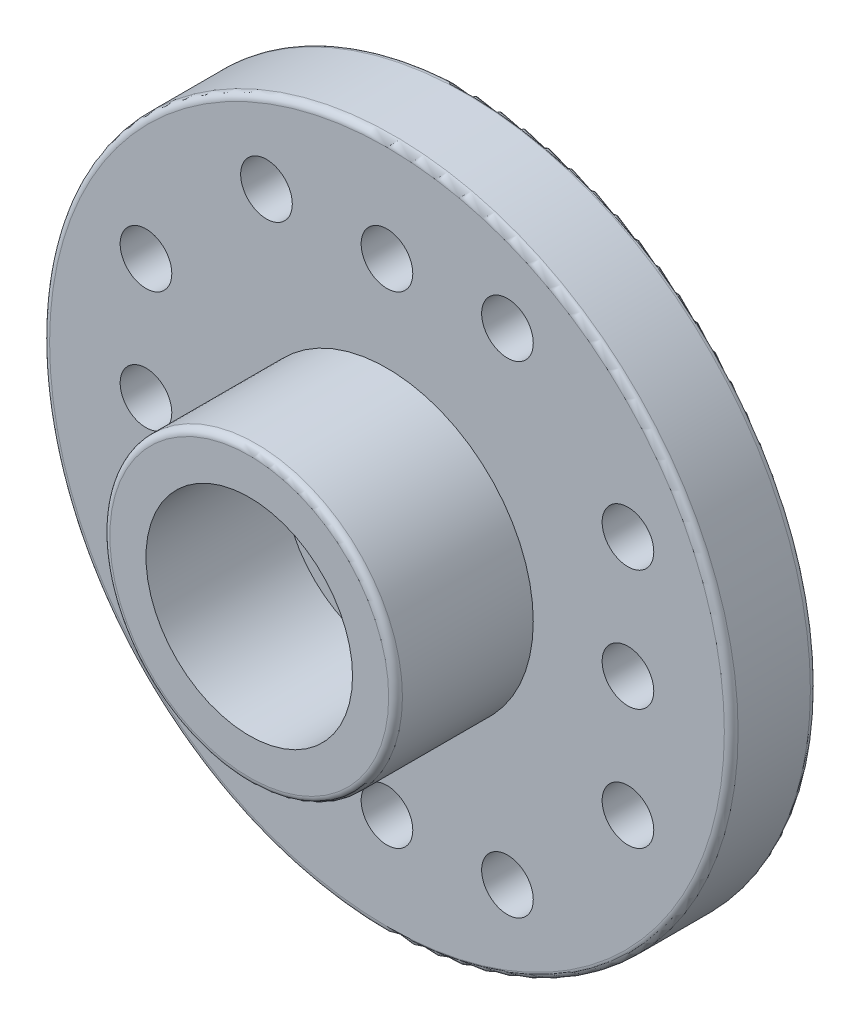
ISO-10303-21;
HEADER;
FILE_DESCRIPTION(('STEP AP214'),'2;1');
FILE_NAME('part.step','',(''),(''),'','','');
FILE_SCHEMA(('AUTOMOTIVE_DESIGN { 1 0 10303 214 1 1 1 1 }'));
ENDSEC;
DATA;
#1=APPLICATION_CONTEXT('core data for automotive mechanical design processes');
#2=APPLICATION_PROTOCOL_DEFINITION('international standard','automotive_design',2000,#1);
#3=PRODUCT_CONTEXT('',#1,'mechanical');
#4=PRODUCT('Part','Part','',(#3));
#5=PRODUCT_RELATED_PRODUCT_CATEGORY('part','',(#4));
#6=PRODUCT_DEFINITION_FORMATION('','',#4);
#7=PRODUCT_DEFINITION_CONTEXT('part definition',#1,'design');
#8=PRODUCT_DEFINITION('design','',#6,#7);
#9=PRODUCT_DEFINITION_SHAPE('','',#8);
#10=(LENGTH_UNIT() NAMED_UNIT(*) SI_UNIT(.MILLI.,.METRE.));
#11=(NAMED_UNIT(*) PLANE_ANGLE_UNIT() SI_UNIT($,.RADIAN.));
#12=(NAMED_UNIT(*) SI_UNIT($,.STERADIAN.) SOLID_ANGLE_UNIT());
#13=UNCERTAINTY_MEASURE_WITH_UNIT(LENGTH_MEASURE(1.E-05),#10,'distance_accuracy_value','');
#14=(GEOMETRIC_REPRESENTATION_CONTEXT(3) GLOBAL_UNCERTAINTY_ASSIGNED_CONTEXT((#13)) GLOBAL_UNIT_ASSIGNED_CONTEXT((#10,
#11,#12)) REPRESENTATION_CONTEXT('',''));
#15=CARTESIAN_POINT('',(0.,0.,0.));
#16=DIRECTION('',(0.,0.,1.));
#17=DIRECTION('',(1.,0.,0.));
#18=AXIS2_PLACEMENT_3D('',#15,#16,#17);
#19=CARTESIAN_POINT('',(0.,0.,0.8));
#20=DIRECTION('',(0.,0.,-1.));
#21=DIRECTION('',(-1.,0.,0.));
#22=AXIS2_PLACEMENT_3D('',#19,#20,#21);
#23=PLANE('',#22);
#24=CARTESIAN_POINT('',(0.,0.,0.8));
#25=DIRECTION('',(0.,0.,-1.));
#26=DIRECTION('',(-1.,0.,0.));
#27=AXIS2_PLACEMENT_3D('',#24,#25,#26);
#28=CIRCLE('',#27,4.5);
#29=CARTESIAN_POINT('',(-4.5,0.,0.8));
#30=VERTEX_POINT('',#29);
#31=EDGE_CURVE('E72',#30,#30,#28,.T.);
#32=ORIENTED_EDGE('',*,*,#31,.T.);
#33=EDGE_LOOP('',(#32));
#34=FACE_BOUND('',#33,.T.);
#35=CARTESIAN_POINT('',(0.,0.,0.8));
#36=DIRECTION('',(0.,0.,-1.));
#37=DIRECTION('',(-1.,0.,0.));
#38=AXIS2_PLACEMENT_3D('',#35,#36,#37);
#39=CIRCLE('',#38,3.7);
#40=CARTESIAN_POINT('',(-3.7,0.,0.8));
#41=VERTEX_POINT('',#40);
#42=EDGE_CURVE('E158',#41,#41,#39,.T.);
#43=ORIENTED_EDGE('',*,*,#42,.F.);
#44=EDGE_LOOP('',(#43));
#45=FACE_BOUND('',#44,.T.);
#46=ADVANCED_FACE('F32',(#34,#45),#23,.T.);
#47=CARTESIAN_POINT('',(0.,0.,2.5));
#48=DIRECTION('',(0.,0.,-1.));
#49=DIRECTION('',(-1.,0.,0.));
#50=AXIS2_PLACEMENT_3D('',#47,#48,#49);
#51=CYLINDRICAL_SURFACE('',#50,1.5);
#52=CARTESIAN_POINT('',(0.,0.,2.5));
#53=DIRECTION('',(0.,0.,1.));
#54=DIRECTION('',(1.,0.,0.));
#55=AXIS2_PLACEMENT_3D('',#52,#53,#54);
#56=CIRCLE('',#55,1.5);
#57=CARTESIAN_POINT('',(1.5,0.,2.5));
#58=VERTEX_POINT('',#57);
#59=EDGE_CURVE('E145',#58,#58,#56,.T.);
#60=ORIENTED_EDGE('',*,*,#59,.T.);
#61=EDGE_LOOP('',(#60));
#62=FACE_BOUND('',#61,.T.);
#63=CARTESIAN_POINT('',(0.,0.,0.8));
#64=DIRECTION('',(0.,0.,-1.));
#65=DIRECTION('',(-1.,0.,0.));
#66=AXIS2_PLACEMENT_3D('',#63,#64,#65);
#67=CIRCLE('',#66,1.5);
#68=CARTESIAN_POINT('',(-1.5,0.,0.8));
#69=VERTEX_POINT('',#68);
#70=EDGE_CURVE('E68',#69,#69,#67,.T.);
#71=ORIENTED_EDGE('',*,*,#70,.T.);
#72=EDGE_LOOP('',(#71));
#73=FACE_BOUND('',#72,.T.);
#74=ADVANCED_FACE('F187',(#62,#73),#51,.F.);
#75=CARTESIAN_POINT('',(0.,0.,2.5));
#76=DIRECTION('',(0.,0.,1.));
#77=DIRECTION('',(1.,0.,0.));
#78=AXIS2_PLACEMENT_3D('',#75,#76,#77);
#79=PLANE('',#78);
#80=CARTESIAN_POINT('',(0.,0.,2.5));
#81=DIRECTION('',(0.,0.,1.));
#82=DIRECTION('',(1.,0.,0.));
#83=AXIS2_PLACEMENT_3D('',#80,#81,#82);
#84=CIRCLE('',#83,9.79999999999866);
#85=CARTESIAN_POINT('',(9.79999999999866,0.,2.5));
#86=VERTEX_POINT('',#85);
#87=EDGE_CURVE('E10',#86,#86,#84,.T.);
#88=ORIENTED_EDGE('',*,*,#87,.T.);
#89=EDGE_LOOP('',(#88));
#90=FACE_BOUND('',#89,.T.);
#91=CARTESIAN_POINT('',(-7.,3.5,2.5));
#92=DIRECTION('',(0.,0.,1.));
#93=DIRECTION('',(1.,0.,0.));
#94=AXIS2_PLACEMENT_3D('',#91,#92,#93);
#95=CIRCLE('',#94,0.749999999999998);
#96=CARTESIAN_POINT('',(-6.25,3.5,2.5));
#97=VERTEX_POINT('',#96);
#98=EDGE_CURVE('E139',#97,#97,#95,.T.);
#99=ORIENTED_EDGE('',*,*,#98,.F.);
#100=EDGE_LOOP('',(#99));
#101=FACE_BOUND('',#100,.T.);
#102=CARTESIAN_POINT('',(-3.49999999999973,-6.99999999999993,2.5));
#103=DIRECTION('',(0.,0.,1.));
#104=DIRECTION('',(1.,0.,0.));
#105=AXIS2_PLACEMENT_3D('',#102,#103,#104);
#106=CIRCLE('',#105,0.749999999999999);
#107=CARTESIAN_POINT('',(-2.74999999999974,-6.99999999999993,2.5));
#108=VERTEX_POINT('',#107);
#109=EDGE_CURVE('E127',#108,#108,#106,.T.);
#110=ORIENTED_EDGE('',*,*,#109,.F.);
#111=EDGE_LOOP('',(#110));
#112=FACE_BOUND('',#111,.T.);
#113=CARTESIAN_POINT('',(2.65831209225568E-13,-6.99999999999993,2.5));
#114=DIRECTION('',(0.,0.,1.));
#115=DIRECTION('',(1.,0.,0.));
#116=AXIS2_PLACEMENT_3D('',#113,#114,#115);
#117=CIRCLE('',#116,0.749999999999999);
#118=CARTESIAN_POINT('',(0.750000000000265,-6.99999999999993,2.5));
#119=VERTEX_POINT('',#118);
#120=EDGE_CURVE('E115',#119,#119,#117,.T.);
#121=ORIENTED_EDGE('',*,*,#120,.F.);
#122=EDGE_LOOP('',(#121));
#123=FACE_BOUND('',#122,.T.);
#124=CARTESIAN_POINT('',(7.0000000000002,3.50000000000033,2.5));
#125=DIRECTION('',(0.,0.,1.));
#126=DIRECTION('',(1.,0.,0.));
#127=AXIS2_PLACEMENT_3D('',#124,#125,#126);
#128=CIRCLE('',#127,0.749999999999998);
#129=CARTESIAN_POINT('',(7.7500000000002,3.50000000000033,2.5));
#130=VERTEX_POINT('',#129);
#131=EDGE_CURVE('E103',#130,#130,#128,.T.);
#132=ORIENTED_EDGE('',*,*,#131,.F.);
#133=EDGE_LOOP('',(#132));
#134=FACE_BOUND('',#133,.T.);
#135=CARTESIAN_POINT('',(3.49999999999993,7.00000000000027,2.5));
#136=DIRECTION('',(0.,0.,1.));
#137=DIRECTION('',(1.,0.,0.));
#138=AXIS2_PLACEMENT_3D('',#135,#136,#137);
#139=CIRCLE('',#138,0.749999999999999);
#140=CARTESIAN_POINT('',(4.24999999999993,7.00000000000027,2.5));
#141=VERTEX_POINT('',#140);
#142=EDGE_CURVE('E91',#141,#141,#139,.T.);
#143=ORIENTED_EDGE('',*,*,#142,.F.);
#144=EDGE_LOOP('',(#143));
#145=FACE_BOUND('',#144,.T.);
#146=CARTESIAN_POINT('',(0.,7.00000000000026,2.5));
#147=DIRECTION('',(0.,0.,1.));
#148=DIRECTION('',(1.,0.,0.));
#149=AXIS2_PLACEMENT_3D('',#146,#147,#148);
#150=CIRCLE('',#149,0.749999999999999);
#151=CARTESIAN_POINT('',(0.74999999999993,7.00000000000026,2.5));
#152=VERTEX_POINT('',#151);
#153=EDGE_CURVE('E79',#152,#152,#150,.T.);
#154=ORIENTED_EDGE('',*,*,#153,.F.);
#155=EDGE_LOOP('',(#154));
#156=FACE_BOUND('',#155,.T.);
#157=CARTESIAN_POINT('',(-7.,0.,2.5));
#158=DIRECTION('',(0.,0.,1.));
#159=DIRECTION('',(1.,0.,0.));
#160=AXIS2_PLACEMENT_3D('',#157,#158,#159);
#161=CIRCLE('',#160,0.749999999999998);
#162=CARTESIAN_POINT('',(-6.25,0.,2.5));
#163=VERTEX_POINT('',#162);
#164=EDGE_CURVE('E75',#163,#163,#161,.T.);
#165=ORIENTED_EDGE('',*,*,#164,.F.);
#166=EDGE_LOOP('',(#165));
#167=FACE_BOUND('',#166,.T.);
#168=CARTESIAN_POINT('',(-3.50000000000007,7.00000000000027,2.5));
#169=DIRECTION('',(0.,0.,1.));
#170=DIRECTION('',(1.,0.,0.));
#171=AXIS2_PLACEMENT_3D('',#168,#169,#170);
#172=CIRCLE('',#171,0.749999999999998);
#173=CARTESIAN_POINT('',(-2.75000000000007,7.00000000000027,2.5));
#174=VERTEX_POINT('',#173);
#175=EDGE_CURVE('E85',#174,#174,#172,.T.);
#176=ORIENTED_EDGE('',*,*,#175,.F.);
#177=EDGE_LOOP('',(#176));
#178=FACE_BOUND('',#177,.T.);
#179=CARTESIAN_POINT('',(7.0000000000002,3.3392416014695E-13,2.5));
#180=DIRECTION('',(0.,0.,1.));
#181=DIRECTION('',(1.,0.,0.));
#182=AXIS2_PLACEMENT_3D('',#179,#180,#181);
#183=CIRCLE('',#182,0.749999999999999);
#184=CARTESIAN_POINT('',(7.7500000000002,3.3392416014695E-13,2.5));
#185=VERTEX_POINT('',#184);
#186=EDGE_CURVE('E97',#185,#185,#183,.T.);
#187=ORIENTED_EDGE('',*,*,#186,.F.);
#188=EDGE_LOOP('',(#187));
#189=FACE_BOUND('',#188,.T.);
#190=CARTESIAN_POINT('',(7.0000000000002,-3.49999999999967,2.5));
#191=DIRECTION('',(0.,0.,1.));
#192=DIRECTION('',(1.,0.,0.));
#193=AXIS2_PLACEMENT_3D('',#190,#191,#192);
#194=CIRCLE('',#193,0.749999999999998);
#195=CARTESIAN_POINT('',(7.7500000000002,-3.49999999999967,2.5));
#196=VERTEX_POINT('',#195);
#197=EDGE_CURVE('E109',#196,#196,#194,.T.);
#198=ORIENTED_EDGE('',*,*,#197,.F.);
#199=EDGE_LOOP('',(#198));
#200=FACE_BOUND('',#199,.T.);
#201=CARTESIAN_POINT('',(3.50000000000027,-6.99999999999993,2.5));
#202=DIRECTION('',(0.,0.,1.));
#203=DIRECTION('',(1.,0.,0.));
#204=AXIS2_PLACEMENT_3D('',#201,#202,#203);
#205=CIRCLE('',#204,0.749999999999998);
#206=CARTESIAN_POINT('',(4.25000000000026,-6.99999999999993,2.5));
#207=VERTEX_POINT('',#206);
#208=EDGE_CURVE('E121',#207,#207,#205,.T.);
#209=ORIENTED_EDGE('',*,*,#208,.F.);
#210=EDGE_LOOP('',(#209));
#211=FACE_BOUND('',#210,.T.);
#212=CARTESIAN_POINT('',(-7.,-3.5,2.5));
#213=DIRECTION('',(0.,0.,1.));
#214=DIRECTION('',(1.,0.,0.));
#215=AXIS2_PLACEMENT_3D('',#212,#213,#214);
#216=CIRCLE('',#215,0.749999999999998);
#217=CARTESIAN_POINT('',(-6.25,-3.5,2.5));
#218=VERTEX_POINT('',#217);
#219=EDGE_CURVE('E133',#218,#218,#216,.T.);
#220=ORIENTED_EDGE('',*,*,#219,.F.);
#221=EDGE_LOOP('',(#220));
#222=FACE_BOUND('',#221,.T.);
#223=CARTESIAN_POINT('',(0.,0.,2.5));
#224=DIRECTION('',(0.,0.,1.));
#225=DIRECTION('',(1.,0.,0.));
#226=AXIS2_PLACEMENT_3D('',#223,#224,#225);
#227=CIRCLE('',#226,4.25);
#228=CARTESIAN_POINT('',(4.25,0.,2.5));
#229=VERTEX_POINT('',#228);
#230=EDGE_CURVE('E150',#229,#229,#227,.T.);
#231=ORIENTED_EDGE('',*,*,#230,.F.);
#232=EDGE_LOOP('',(#231));
#233=FACE_BOUND('',#232,.T.);
#234=ADVANCED_FACE('F192',(#90,#101,#112,#123,#134,#145,#156,#167,#178,#189,#200,#211,#222,
#233),#79,.T.);
#235=CARTESIAN_POINT('',(0.,0.,2.5));
#236=DIRECTION('',(0.,0.,1.));
#237=DIRECTION('',(1.,0.,0.));
#238=AXIS2_PLACEMENT_3D('',#235,#236,#237);
#239=CIRCLE('',#238,3.);
#240=CARTESIAN_POINT('',(3.,0.,2.5));
#241=VERTEX_POINT('',#240);
#242=EDGE_CURVE('E67',#241,#241,#239,.F.);
#243=ORIENTED_EDGE('',*,*,#242,.F.);
#244=EDGE_LOOP('',(#243));
#245=FACE_BOUND('',#244,.T.);
#246=ORIENTED_EDGE('',*,*,#59,.F.);
#247=EDGE_LOOP('',(#246));
#248=FACE_BOUND('',#247,.T.);
#249=ADVANCED_FACE('F261',(#245,#248),#79,.T.);
#250=CARTESIAN_POINT('',(0.,0.,0.));
#251=DIRECTION('',(0.,0.,1.));
#252=DIRECTION('',(1.,0.,0.));
#253=AXIS2_PLACEMENT_3D('',#250,#251,#252);
#254=PLANE('',#253);
#255=CARTESIAN_POINT('',(0.,0.,0.));
#256=DIRECTION('',(0.,0.,1.));
#257=DIRECTION('',(1.,0.,0.));
#258=AXIS2_PLACEMENT_3D('',#255,#256,#257);
#259=CIRCLE('',#258,4.7);
#260=CARTESIAN_POINT('',(4.7,0.,0.));
#261=VERTEX_POINT('',#260);
#262=EDGE_CURVE('E55',#261,#261,#259,.T.);
#263=ORIENTED_EDGE('',*,*,#262,.T.);
#264=EDGE_LOOP('',(#263));
#265=FACE_BOUND('',#264,.T.);
#266=CARTESIAN_POINT('',(0.,0.,0.));
#267=DIRECTION('',(0.,0.,1.));
#268=DIRECTION('',(1.,0.,0.));
#269=AXIS2_PLACEMENT_3D('',#266,#267,#268);
#270=CIRCLE('',#269,9.79999999999866);
#271=CARTESIAN_POINT('',(9.79999999999866,0.,0.));
#272=VERTEX_POINT('',#271);
#273=EDGE_CURVE('E58',#272,#272,#270,.F.);
#274=ORIENTED_EDGE('',*,*,#273,.T.);
#275=EDGE_LOOP('',(#274));
#276=FACE_BOUND('',#275,.T.);
#277=CARTESIAN_POINT('',(-7.,3.5,0.));
#278=DIRECTION('',(0.,0.,1.));
#279=DIRECTION('',(1.,0.,0.));
#280=AXIS2_PLACEMENT_3D('',#277,#278,#279);
#281=CIRCLE('',#280,0.749999999999998);
#282=CARTESIAN_POINT('',(-6.25,3.5,0.));
#283=VERTEX_POINT('',#282);
#284=EDGE_CURVE('E142',#283,#283,#281,.T.);
#285=ORIENTED_EDGE('',*,*,#284,.T.);
#286=EDGE_LOOP('',(#285));
#287=FACE_BOUND('',#286,.T.);
#288=CARTESIAN_POINT('',(-3.49999999999973,-6.99999999999993,0.));
#289=DIRECTION('',(0.,0.,1.));
#290=DIRECTION('',(1.,0.,0.));
#291=AXIS2_PLACEMENT_3D('',#288,#289,#290);
#292=CIRCLE('',#291,0.749999999999999);
#293=CARTESIAN_POINT('',(-2.74999999999974,-6.99999999999993,0.));
#294=VERTEX_POINT('',#293);
#295=EDGE_CURVE('E130',#294,#294,#292,.T.);
#296=ORIENTED_EDGE('',*,*,#295,.T.);
#297=EDGE_LOOP('',(#296));
#298=FACE_BOUND('',#297,.T.);
#299=CARTESIAN_POINT('',(2.65831209225568E-13,-6.99999999999993,0.));
#300=DIRECTION('',(0.,0.,1.));
#301=DIRECTION('',(1.,0.,0.));
#302=AXIS2_PLACEMENT_3D('',#299,#300,#301);
#303=CIRCLE('',#302,0.749999999999999);
#304=CARTESIAN_POINT('',(0.750000000000265,-6.99999999999993,0.));
#305=VERTEX_POINT('',#304);
#306=EDGE_CURVE('E118',#305,#305,#303,.T.);
#307=ORIENTED_EDGE('',*,*,#306,.T.);
#308=EDGE_LOOP('',(#307));
#309=FACE_BOUND('',#308,.T.);
#310=CARTESIAN_POINT('',(7.0000000000002,3.50000000000033,0.));
#311=DIRECTION('',(0.,0.,1.));
#312=DIRECTION('',(1.,0.,0.));
#313=AXIS2_PLACEMENT_3D('',#310,#311,#312);
#314=CIRCLE('',#313,0.749999999999998);
#315=CARTESIAN_POINT('',(7.7500000000002,3.50000000000033,0.));
#316=VERTEX_POINT('',#315);
#317=EDGE_CURVE('E106',#316,#316,#314,.T.);
#318=ORIENTED_EDGE('',*,*,#317,.T.);
#319=EDGE_LOOP('',(#318));
#320=FACE_BOUND('',#319,.T.);
#321=CARTESIAN_POINT('',(3.49999999999993,7.00000000000027,0.));
#322=DIRECTION('',(0.,0.,1.));
#323=DIRECTION('',(1.,0.,0.));
#324=AXIS2_PLACEMENT_3D('',#321,#322,#323);
#325=CIRCLE('',#324,0.749999999999999);
#326=CARTESIAN_POINT('',(4.24999999999993,7.00000000000027,0.));
#327=VERTEX_POINT('',#326);
#328=EDGE_CURVE('E94',#327,#327,#325,.T.);
#329=ORIENTED_EDGE('',*,*,#328,.T.);
#330=EDGE_LOOP('',(#329));
#331=FACE_BOUND('',#330,.T.);
#332=CARTESIAN_POINT('',(0.,7.00000000000026,0.));
#333=DIRECTION('',(0.,0.,1.));
#334=DIRECTION('',(1.,0.,0.));
#335=AXIS2_PLACEMENT_3D('',#332,#333,#334);
#336=CIRCLE('',#335,0.749999999999999);
#337=CARTESIAN_POINT('',(0.74999999999993,7.00000000000026,0.));
#338=VERTEX_POINT('',#337);
#339=EDGE_CURVE('E82',#338,#338,#336,.T.);
#340=ORIENTED_EDGE('',*,*,#339,.T.);
#341=EDGE_LOOP('',(#340));
#342=FACE_BOUND('',#341,.T.);
#343=CARTESIAN_POINT('',(-7.,0.,0.));
#344=DIRECTION('',(0.,0.,1.));
#345=DIRECTION('',(1.,0.,0.));
#346=AXIS2_PLACEMENT_3D('',#343,#344,#345);
#347=CIRCLE('',#346,0.749999999999998);
#348=CARTESIAN_POINT('',(-6.25,0.,0.));
#349=VERTEX_POINT('',#348);
#350=EDGE_CURVE('E76',#349,#349,#347,.T.);
#351=ORIENTED_EDGE('',*,*,#350,.T.);
#352=EDGE_LOOP('',(#351));
#353=FACE_BOUND('',#352,.T.);
#354=CARTESIAN_POINT('',(-3.50000000000007,7.00000000000027,0.));
#355=DIRECTION('',(0.,0.,1.));
#356=DIRECTION('',(1.,0.,0.));
#357=AXIS2_PLACEMENT_3D('',#354,#355,#356);
#358=CIRCLE('',#357,0.749999999999998);
#359=CARTESIAN_POINT('',(-2.75000000000007,7.00000000000027,0.));
#360=VERTEX_POINT('',#359);
#361=EDGE_CURVE('E88',#360,#360,#358,.T.);
#362=ORIENTED_EDGE('',*,*,#361,.T.);
#363=EDGE_LOOP('',(#362));
#364=FACE_BOUND('',#363,.T.);
#365=CARTESIAN_POINT('',(7.0000000000002,3.3392416014695E-13,0.));
#366=DIRECTION('',(0.,0.,1.));
#367=DIRECTION('',(1.,0.,0.));
#368=AXIS2_PLACEMENT_3D('',#365,#366,#367);
#369=CIRCLE('',#368,0.749999999999999);
#370=CARTESIAN_POINT('',(7.7500000000002,3.3392416014695E-13,0.));
#371=VERTEX_POINT('',#370);
#372=EDGE_CURVE('E100',#371,#371,#369,.T.);
#373=ORIENTED_EDGE('',*,*,#372,.T.);
#374=EDGE_LOOP('',(#373));
#375=FACE_BOUND('',#374,.T.);
#376=CARTESIAN_POINT('',(7.0000000000002,-3.49999999999967,0.));
#377=DIRECTION('',(0.,0.,1.));
#378=DIRECTION('',(1.,0.,0.));
#379=AXIS2_PLACEMENT_3D('',#376,#377,#378);
#380=CIRCLE('',#379,0.749999999999998);
#381=CARTESIAN_POINT('',(7.7500000000002,-3.49999999999967,0.));
#382=VERTEX_POINT('',#381);
#383=EDGE_CURVE('E112',#382,#382,#380,.T.);
#384=ORIENTED_EDGE('',*,*,#383,.T.);
#385=EDGE_LOOP('',(#384));
#386=FACE_BOUND('',#385,.T.);
#387=CARTESIAN_POINT('',(3.50000000000027,-6.99999999999993,0.));
#388=DIRECTION('',(0.,0.,1.));
#389=DIRECTION('',(1.,0.,0.));
#390=AXIS2_PLACEMENT_3D('',#387,#388,#389);
#391=CIRCLE('',#390,0.749999999999998);
#392=CARTESIAN_POINT('',(4.25000000000026,-6.99999999999993,0.));
#393=VERTEX_POINT('',#392);
#394=EDGE_CURVE('E124',#393,#393,#391,.T.);
#395=ORIENTED_EDGE('',*,*,#394,.T.);
#396=EDGE_LOOP('',(#395));
#397=FACE_BOUND('',#396,.T.);
#398=CARTESIAN_POINT('',(-7.,-3.5,0.));
#399=DIRECTION('',(0.,0.,1.));
#400=DIRECTION('',(1.,0.,0.));
#401=AXIS2_PLACEMENT_3D('',#398,#399,#400);
#402=CIRCLE('',#401,0.749999999999998);
#403=CARTESIAN_POINT('',(-6.25,-3.5,0.));
#404=VERTEX_POINT('',#403);
#405=EDGE_CURVE('E136',#404,#404,#402,.T.);
#406=ORIENTED_EDGE('',*,*,#405,.T.);
#407=EDGE_LOOP('',(#406));
#408=FACE_BOUND('',#407,.T.);
#409=ADVANCED_FACE('F264',(#265,#276,#287,#298,#309,#320,#331,#342,#353,#364,#375,#386,#397,
#408),#254,.F.);
#410=CARTESIAN_POINT('',(0.,0.,2.5));
#411=DIRECTION('',(0.,0.,-1.));
#412=DIRECTION('',(-1.,0.,0.));
#413=AXIS2_PLACEMENT_3D('',#410,#411,#412);
#414=CYLINDRICAL_SURFACE('',#413,9.99999999999866);
#415=CARTESIAN_POINT('',(0.,0.,0.2));
#416=DIRECTION('',(0.,0.,1.));
#417=DIRECTION('',(1.,0.,0.));
#418=AXIS2_PLACEMENT_3D('',#415,#416,#417);
#419=CIRCLE('',#418,9.99999999999866);
#420=CARTESIAN_POINT('',(9.99999999999866,0.,0.2));
#421=VERTEX_POINT('',#420);
#422=EDGE_CURVE('E39',#421,#421,#419,.T.);
#423=ORIENTED_EDGE('',*,*,#422,.T.);
#424=EDGE_LOOP('',(#423));
#425=FACE_BOUND('',#424,.T.);
#426=CARTESIAN_POINT('',(0.,0.,2.3));
#427=DIRECTION('',(0.,0.,1.));
#428=DIRECTION('',(1.,0.,0.));
#429=AXIS2_PLACEMENT_3D('',#426,#427,#428);
#430=CIRCLE('',#429,9.99999999999866);
#431=CARTESIAN_POINT('',(9.99999999999866,0.,2.3));
#432=VERTEX_POINT('',#431);
#433=EDGE_CURVE('E43',#432,#432,#430,.F.);
#434=ORIENTED_EDGE('',*,*,#433,.T.);
#435=EDGE_LOOP('',(#434));
#436=FACE_BOUND('',#435,.T.);
#437=ADVANCED_FACE('F259',(#425,#436),#414,.T.);
#438=CARTESIAN_POINT('',(-7.,0.,2.5));
#439=DIRECTION('',(0.,0.,-1.));
#440=DIRECTION('',(-1.,0.,0.));
#441=AXIS2_PLACEMENT_3D('',#438,#439,#440);
#442=CYLINDRICAL_SURFACE('',#441,0.749999999999998);
#443=ORIENTED_EDGE('',*,*,#164,.T.);
#444=EDGE_LOOP('',(#443));
#445=FACE_BOUND('',#444,.T.);
#446=ORIENTED_EDGE('',*,*,#350,.F.);
#447=EDGE_LOOP('',(#446));
#448=FACE_BOUND('',#447,.T.);
#449=ADVANCED_FACE('F255',(#445,#448),#442,.F.);
#450=CARTESIAN_POINT('',(0.,7.00000000000026,2.5));
#451=DIRECTION('',(0.,0.,-1.));
#452=DIRECTION('',(-1.,0.,0.));
#453=AXIS2_PLACEMENT_3D('',#450,#451,#452);
#454=CYLINDRICAL_SURFACE('',#453,0.749999999999999);
#455=ORIENTED_EDGE('',*,*,#153,.T.);
#456=EDGE_LOOP('',(#455));
#457=FACE_BOUND('',#456,.T.);
#458=ORIENTED_EDGE('',*,*,#339,.F.);
#459=EDGE_LOOP('',(#458));
#460=FACE_BOUND('',#459,.T.);
#461=ADVANCED_FACE('F251',(#457,#460),#454,.F.);
#462=CARTESIAN_POINT('',(-3.50000000000007,7.00000000000027,2.5));
#463=DIRECTION('',(0.,0.,-1.));
#464=DIRECTION('',(-1.,0.,0.));
#465=AXIS2_PLACEMENT_3D('',#462,#463,#464);
#466=CYLINDRICAL_SURFACE('',#465,0.749999999999998);
#467=ORIENTED_EDGE('',*,*,#175,.T.);
#468=EDGE_LOOP('',(#467));
#469=FACE_BOUND('',#468,.T.);
#470=ORIENTED_EDGE('',*,*,#361,.F.);
#471=EDGE_LOOP('',(#470));
#472=FACE_BOUND('',#471,.T.);
#473=ADVANCED_FACE('F247',(#469,#472),#466,.F.);
#474=CARTESIAN_POINT('',(3.49999999999993,7.00000000000027,2.5));
#475=DIRECTION('',(0.,0.,-1.));
#476=DIRECTION('',(-1.,0.,0.));
#477=AXIS2_PLACEMENT_3D('',#474,#475,#476);
#478=CYLINDRICAL_SURFACE('',#477,0.749999999999999);
#479=ORIENTED_EDGE('',*,*,#142,.T.);
#480=EDGE_LOOP('',(#479));
#481=FACE_BOUND('',#480,.T.);
#482=ORIENTED_EDGE('',*,*,#328,.F.);
#483=EDGE_LOOP('',(#482));
#484=FACE_BOUND('',#483,.T.);
#485=ADVANCED_FACE('F243',(#481,#484),#478,.F.);
#486=CARTESIAN_POINT('',(7.0000000000002,3.3392416014695E-13,2.5));
#487=DIRECTION('',(0.,0.,-1.));
#488=DIRECTION('',(-1.,0.,0.));
#489=AXIS2_PLACEMENT_3D('',#486,#487,#488);
#490=CYLINDRICAL_SURFACE('',#489,0.749999999999999);
#491=ORIENTED_EDGE('',*,*,#186,.T.);
#492=EDGE_LOOP('',(#491));
#493=FACE_BOUND('',#492,.T.);
#494=ORIENTED_EDGE('',*,*,#372,.F.);
#495=EDGE_LOOP('',(#494));
#496=FACE_BOUND('',#495,.T.);
#497=ADVANCED_FACE('F239',(#493,#496),#490,.F.);
#498=CARTESIAN_POINT('',(7.0000000000002,3.50000000000033,2.5));
#499=DIRECTION('',(0.,0.,-1.));
#500=DIRECTION('',(-1.,0.,0.));
#501=AXIS2_PLACEMENT_3D('',#498,#499,#500);
#502=CYLINDRICAL_SURFACE('',#501,0.749999999999998);
#503=ORIENTED_EDGE('',*,*,#131,.T.);
#504=EDGE_LOOP('',(#503));
#505=FACE_BOUND('',#504,.T.);
#506=ORIENTED_EDGE('',*,*,#317,.F.);
#507=EDGE_LOOP('',(#506));
#508=FACE_BOUND('',#507,.T.);
#509=ADVANCED_FACE('F235',(#505,#508),#502,.F.);
#510=CARTESIAN_POINT('',(7.0000000000002,-3.49999999999967,2.5));
#511=DIRECTION('',(0.,0.,-1.));
#512=DIRECTION('',(-1.,0.,0.));
#513=AXIS2_PLACEMENT_3D('',#510,#511,#512);
#514=CYLINDRICAL_SURFACE('',#513,0.749999999999998);
#515=ORIENTED_EDGE('',*,*,#197,.T.);
#516=EDGE_LOOP('',(#515));
#517=FACE_BOUND('',#516,.T.);
#518=ORIENTED_EDGE('',*,*,#383,.F.);
#519=EDGE_LOOP('',(#518));
#520=FACE_BOUND('',#519,.T.);
#521=ADVANCED_FACE('F231',(#517,#520),#514,.F.);
#522=CARTESIAN_POINT('',(2.65831209225568E-13,-6.99999999999993,2.5));
#523=DIRECTION('',(0.,0.,-1.));
#524=DIRECTION('',(-1.,0.,0.));
#525=AXIS2_PLACEMENT_3D('',#522,#523,#524);
#526=CYLINDRICAL_SURFACE('',#525,0.749999999999999);
#527=ORIENTED_EDGE('',*,*,#120,.T.);
#528=EDGE_LOOP('',(#527));
#529=FACE_BOUND('',#528,.T.);
#530=ORIENTED_EDGE('',*,*,#306,.F.);
#531=EDGE_LOOP('',(#530));
#532=FACE_BOUND('',#531,.T.);
#533=ADVANCED_FACE('F227',(#529,#532),#526,.F.);
#534=CARTESIAN_POINT('',(3.50000000000027,-6.99999999999993,2.5));
#535=DIRECTION('',(0.,0.,-1.));
#536=DIRECTION('',(-1.,0.,0.));
#537=AXIS2_PLACEMENT_3D('',#534,#535,#536);
#538=CYLINDRICAL_SURFACE('',#537,0.749999999999998);
#539=ORIENTED_EDGE('',*,*,#208,.T.);
#540=EDGE_LOOP('',(#539));
#541=FACE_BOUND('',#540,.T.);
#542=ORIENTED_EDGE('',*,*,#394,.F.);
#543=EDGE_LOOP('',(#542));
#544=FACE_BOUND('',#543,.T.);
#545=ADVANCED_FACE('F223',(#541,#544),#538,.F.);
#546=CARTESIAN_POINT('',(-3.49999999999973,-6.99999999999993,2.5));
#547=DIRECTION('',(0.,0.,-1.));
#548=DIRECTION('',(-1.,0.,0.));
#549=AXIS2_PLACEMENT_3D('',#546,#547,#548);
#550=CYLINDRICAL_SURFACE('',#549,0.749999999999999);
#551=ORIENTED_EDGE('',*,*,#109,.T.);
#552=EDGE_LOOP('',(#551));
#553=FACE_BOUND('',#552,.T.);
#554=ORIENTED_EDGE('',*,*,#295,.F.);
#555=EDGE_LOOP('',(#554));
#556=FACE_BOUND('',#555,.T.);
#557=ADVANCED_FACE('F219',(#553,#556),#550,.F.);
#558=CARTESIAN_POINT('',(-7.,-3.5,2.5));
#559=DIRECTION('',(0.,0.,-1.));
#560=DIRECTION('',(-1.,0.,0.));
#561=AXIS2_PLACEMENT_3D('',#558,#559,#560);
#562=CYLINDRICAL_SURFACE('',#561,0.749999999999998);
#563=ORIENTED_EDGE('',*,*,#219,.T.);
#564=EDGE_LOOP('',(#563));
#565=FACE_BOUND('',#564,.T.);
#566=ORIENTED_EDGE('',*,*,#405,.F.);
#567=EDGE_LOOP('',(#566));
#568=FACE_BOUND('',#567,.T.);
#569=ADVANCED_FACE('F215',(#565,#568),#562,.F.);
#570=CARTESIAN_POINT('',(-7.,3.5,2.5));
#571=DIRECTION('',(0.,0.,-1.));
#572=DIRECTION('',(-1.,0.,0.));
#573=AXIS2_PLACEMENT_3D('',#570,#571,#572);
#574=CYLINDRICAL_SURFACE('',#573,0.749999999999998);
#575=ORIENTED_EDGE('',*,*,#98,.T.);
#576=EDGE_LOOP('',(#575));
#577=FACE_BOUND('',#576,.T.);
#578=ORIENTED_EDGE('',*,*,#284,.F.);
#579=EDGE_LOOP('',(#578));
#580=FACE_BOUND('',#579,.T.);
#581=ADVANCED_FACE('F208',(#577,#580),#574,.F.);
#582=CARTESIAN_POINT('',(0.,0.,6.5));
#583=DIRECTION('',(0.,0.,1.));
#584=DIRECTION('',(1.,0.,0.));
#585=AXIS2_PLACEMENT_3D('',#582,#583,#584);
#586=PLANE('',#585);
#587=CARTESIAN_POINT('',(0.,0.,6.5));
#588=DIRECTION('',(0.,0.,1.));
#589=DIRECTION('',(1.,0.,0.));
#590=AXIS2_PLACEMENT_3D('',#587,#588,#589);
#591=CIRCLE('',#590,4.05);
#592=CARTESIAN_POINT('',(4.05,0.,6.5));
#593=VERTEX_POINT('',#592);
#594=EDGE_CURVE('E52',#593,#593,#591,.T.);
#595=ORIENTED_EDGE('',*,*,#594,.T.);
#596=EDGE_LOOP('',(#595));
#597=FACE_BOUND('',#596,.T.);
#598=CARTESIAN_POINT('',(0.,0.,6.5));
#599=DIRECTION('',(0.,0.,1.));
#600=DIRECTION('',(1.,0.,0.));
#601=AXIS2_PLACEMENT_3D('',#598,#599,#600);
#602=CIRCLE('',#601,3.);
#603=CARTESIAN_POINT('',(3.,0.,6.5));
#604=VERTEX_POINT('',#603);
#605=EDGE_CURVE('E71',#604,#604,#602,.T.);
#606=ORIENTED_EDGE('',*,*,#605,.F.);
#607=EDGE_LOOP('',(#606));
#608=FACE_BOUND('',#607,.T.);
#609=ADVANCED_FACE('F205',(#597,#608),#586,.T.);
#610=CARTESIAN_POINT('',(0.,0.,6.5));
#611=DIRECTION('',(0.,0.,-1.));
#612=DIRECTION('',(-1.,0.,0.));
#613=AXIS2_PLACEMENT_3D('',#610,#611,#612);
#614=CYLINDRICAL_SURFACE('',#613,4.25);
#615=CARTESIAN_POINT('',(0.,0.,6.3));
#616=DIRECTION('',(0.,0.,1.));
#617=DIRECTION('',(1.,0.,0.));
#618=AXIS2_PLACEMENT_3D('',#615,#616,#617);
#619=CIRCLE('',#618,4.25);
#620=CARTESIAN_POINT('',(4.25,0.,6.3));
#621=VERTEX_POINT('',#620);
#622=EDGE_CURVE('E47',#621,#621,#619,.F.);
#623=ORIENTED_EDGE('',*,*,#622,.T.);
#624=EDGE_LOOP('',(#623));
#625=FACE_BOUND('',#624,.T.);
#626=ORIENTED_EDGE('',*,*,#230,.T.);
#627=EDGE_LOOP('',(#626));
#628=FACE_BOUND('',#627,.T.);
#629=ADVANCED_FACE('F203',(#625,#628),#614,.T.);
#630=CARTESIAN_POINT('',(0.,0.,6.5));
#631=DIRECTION('',(0.,0.,-1.));
#632=DIRECTION('',(-1.,0.,0.));
#633=AXIS2_PLACEMENT_3D('',#630,#631,#632);
#634=CYLINDRICAL_SURFACE('',#633,3.);
#635=ORIENTED_EDGE('',*,*,#605,.T.);
#636=EDGE_LOOP('',(#635));
#637=FACE_BOUND('',#636,.T.);
#638=ORIENTED_EDGE('',*,*,#242,.T.);
#639=EDGE_LOOP('',(#638));
#640=FACE_BOUND('',#639,.T.);
#641=ADVANCED_FACE('F199',(#637,#640),#634,.F.);
#642=CARTESIAN_POINT('',(0.,0.,0.8));
#643=DIRECTION('',(0.,0.,-1.));
#644=DIRECTION('',(-1.,0.,0.));
#645=AXIS2_PLACEMENT_3D('',#642,#643,#644);
#646=CYLINDRICAL_SURFACE('',#645,4.5);
#647=CARTESIAN_POINT('',(0.,0.,0.2));
#648=DIRECTION('',(0.,0.,1.));
#649=DIRECTION('',(1.,0.,0.));
#650=AXIS2_PLACEMENT_3D('',#647,#648,#649);
#651=CIRCLE('',#650,4.5);
#652=CARTESIAN_POINT('',(4.5,0.,0.2));
#653=VERTEX_POINT('',#652);
#654=EDGE_CURVE('E61',#653,#653,#651,.F.);
#655=ORIENTED_EDGE('',*,*,#654,.T.);
#656=EDGE_LOOP('',(#655));
#657=FACE_BOUND('',#656,.T.);
#658=ORIENTED_EDGE('',*,*,#31,.F.);
#659=EDGE_LOOP('',(#658));
#660=FACE_BOUND('',#659,.T.);
#661=ADVANCED_FACE('F182',(#657,#660),#646,.F.);
#662=CARTESIAN_POINT('',(0.,0.,0.8));
#663=DIRECTION('',(0.,0.,-1.));
#664=DIRECTION('',(-1.,0.,0.));
#665=AXIS2_PLACEMENT_3D('',#662,#663,#664);
#666=CIRCLE('',#665,3.5);
#667=CARTESIAN_POINT('',(-3.5,0.,0.8));
#668=VERTEX_POINT('',#667);
#669=EDGE_CURVE('E64',#668,#668,#666,.F.);
#670=ORIENTED_EDGE('',*,*,#669,.F.);
#671=EDGE_LOOP('',(#670));
#672=FACE_BOUND('',#671,.T.);
#673=ORIENTED_EDGE('',*,*,#70,.F.);
#674=EDGE_LOOP('',(#673));
#675=FACE_BOUND('',#674,.T.);
#676=ADVANCED_FACE('F173',(#672,#675),#23,.T.);
#677=CARTESIAN_POINT('',(0.,0.,0.));
#678=DIRECTION('',(0.,0.,-1.));
#679=DIRECTION('',(-1.,0.,0.));
#680=AXIS2_PLACEMENT_3D('',#677,#678,#679);
#681=PLANE('',#680);
#682=CARTESIAN_POINT('',(0.,0.,0.));
#683=DIRECTION('',(0.,0.,-1.));
#684=DIRECTION('',(-1.,0.,0.));
#685=AXIS2_PLACEMENT_3D('',#682,#683,#684);
#686=CIRCLE('',#685,3.7);
#687=CARTESIAN_POINT('',(-3.7,0.,0.));
#688=VERTEX_POINT('',#687);
#689=EDGE_CURVE('E157',#688,#688,#686,.T.);
#690=ORIENTED_EDGE('',*,*,#689,.T.);
#691=EDGE_LOOP('',(#690));
#692=FACE_BOUND('',#691,.T.);
#693=CARTESIAN_POINT('',(0.,0.,0.));
#694=DIRECTION('',(0.,0.,-1.));
#695=DIRECTION('',(-1.,0.,0.));
#696=AXIS2_PLACEMENT_3D('',#693,#694,#695);
#697=CIRCLE('',#696,3.5);
#698=CARTESIAN_POINT('',(-3.5,0.,0.));
#699=VERTEX_POINT('',#698);
#700=EDGE_CURVE('E161',#699,#699,#697,.T.);
#701=ORIENTED_EDGE('',*,*,#700,.F.);
#702=EDGE_LOOP('',(#701));
#703=FACE_BOUND('',#702,.T.);
#704=ADVANCED_FACE('F170',(#692,#703),#681,.T.);
#705=CARTESIAN_POINT('',(0.,0.,0.));
#706=DIRECTION('',(0.,0.,1.));
#707=DIRECTION('',(1.,0.,0.));
#708=AXIS2_PLACEMENT_3D('',#705,#706,#707);
#709=CYLINDRICAL_SURFACE('',#708,3.7);
#710=ORIENTED_EDGE('',*,*,#689,.F.);
#711=EDGE_LOOP('',(#710));
#712=FACE_BOUND('',#711,.T.);
#713=ORIENTED_EDGE('',*,*,#42,.T.);
#714=EDGE_LOOP('',(#713));
#715=FACE_BOUND('',#714,.T.);
#716=ADVANCED_FACE('F172',(#712,#715),#709,.T.);
#717=CARTESIAN_POINT('',(0.,0.,0.));
#718=DIRECTION('',(0.,0.,1.));
#719=DIRECTION('',(1.,0.,0.));
#720=AXIS2_PLACEMENT_3D('',#717,#718,#719);
#721=CYLINDRICAL_SURFACE('',#720,3.5);
#722=ORIENTED_EDGE('',*,*,#700,.T.);
#723=EDGE_LOOP('',(#722));
#724=FACE_BOUND('',#723,.T.);
#725=ORIENTED_EDGE('',*,*,#669,.T.);
#726=EDGE_LOOP('',(#725));
#727=FACE_BOUND('',#726,.T.);
#728=ADVANCED_FACE('F167',(#724,#727),#721,.F.);
#729=CARTESIAN_POINT('',(0.,0.,0.2));
#730=DIRECTION('',(0.,0.,1.));
#731=DIRECTION('',(1.,0.,0.));
#732=AXIS2_PLACEMENT_3D('',#729,#730,#731);
#733=TOROIDAL_SURFACE('',#732,4.7,0.2);
#734=ORIENTED_EDGE('',*,*,#262,.F.);
#735=EDGE_LOOP('',(#734));
#736=FACE_BOUND('',#735,.T.);
#737=ORIENTED_EDGE('',*,*,#654,.F.);
#738=EDGE_LOOP('',(#737));
#739=FACE_BOUND('',#738,.T.);
#740=ADVANCED_FACE('F271',(#736,#739),#733,.T.);
#741=CARTESIAN_POINT('',(0.,0.,6.3));
#742=DIRECTION('',(0.,0.,1.));
#743=DIRECTION('',(1.,0.,0.));
#744=AXIS2_PLACEMENT_3D('',#741,#742,#743);
#745=TOROIDAL_SURFACE('',#744,4.05,0.2);
#746=ORIENTED_EDGE('',*,*,#622,.F.);
#747=EDGE_LOOP('',(#746));
#748=FACE_BOUND('',#747,.T.);
#749=ORIENTED_EDGE('',*,*,#594,.F.);
#750=EDGE_LOOP('',(#749));
#751=FACE_BOUND('',#750,.T.);
#752=ADVANCED_FACE('F274',(#748,#751),#745,.T.);
#753=CARTESIAN_POINT('',(0.,0.,0.2));
#754=DIRECTION('',(0.,0.,1.));
#755=DIRECTION('',(1.,0.,0.));
#756=AXIS2_PLACEMENT_3D('',#753,#754,#755);
#757=TOROIDAL_SURFACE('',#756,9.79999999999866,0.2);
#758=ORIENTED_EDGE('',*,*,#273,.F.);
#759=EDGE_LOOP('',(#758));
#760=FACE_BOUND('',#759,.T.);
#761=ORIENTED_EDGE('',*,*,#422,.F.);
#762=EDGE_LOOP('',(#761));
#763=FACE_BOUND('',#762,.T.);
#764=ADVANCED_FACE('F277',(#760,#763),#757,.T.);
#765=CARTESIAN_POINT('',(0.,0.,2.3));
#766=DIRECTION('',(0.,0.,1.));
#767=DIRECTION('',(1.,0.,0.));
#768=AXIS2_PLACEMENT_3D('',#765,#766,#767);
#769=TOROIDAL_SURFACE('',#768,9.79999999999866,0.2);
#770=ORIENTED_EDGE('',*,*,#433,.F.);
#771=EDGE_LOOP('',(#770));
#772=FACE_BOUND('',#771,.T.);
#773=ORIENTED_EDGE('',*,*,#87,.F.);
#774=EDGE_LOOP('',(#773));
#775=FACE_BOUND('',#774,.T.);
#776=ADVANCED_FACE('F34',(#772,#775),#769,.T.);
#777=CLOSED_SHELL('',(#46,#74,#234,#249,#409,#437,#449,#461,#473,#485,#497,#509,#521,#533,#545,
#557,#569,#581,#609,#629,#641,#661,#676,#704,#716,#728,#740,#752,#764,#776));
#778=MANIFOLD_SOLID_BREP('B2',#777);
#779=ADVANCED_BREP_SHAPE_REPRESENTATION('',(#18,#778),#14);
#780=SHAPE_DEFINITION_REPRESENTATION(#9,#779);
ENDSEC;
END-ISO-10303-21;
